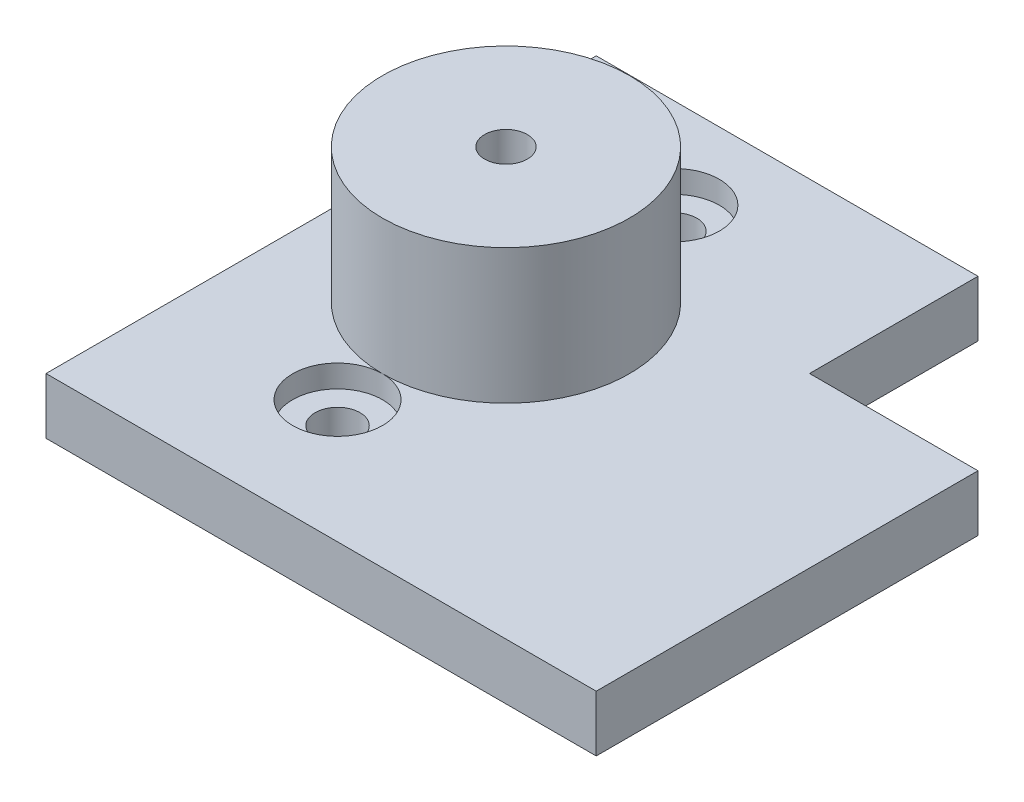
ISO-10303-21;
HEADER;
FILE_DESCRIPTION(('STEP AP214'),'2;1');
FILE_NAME('part.step','',(''),(''),'','','');
FILE_SCHEMA(('AUTOMOTIVE_DESIGN { 1 0 10303 214 1 1 1 1 }'));
ENDSEC;
DATA;
#1=APPLICATION_CONTEXT('core data for automotive mechanical design processes');
#2=APPLICATION_PROTOCOL_DEFINITION('international standard','automotive_design',2000,#1);
#3=PRODUCT_CONTEXT('',#1,'mechanical');
#4=PRODUCT('Part','Part','',(#3));
#5=PRODUCT_RELATED_PRODUCT_CATEGORY('part','',(#4));
#6=PRODUCT_DEFINITION_FORMATION('','',#4);
#7=PRODUCT_DEFINITION_CONTEXT('part definition',#1,'design');
#8=PRODUCT_DEFINITION('design','',#6,#7);
#9=PRODUCT_DEFINITION_SHAPE('','',#8);
#10=(LENGTH_UNIT() NAMED_UNIT(*) SI_UNIT(.MILLI.,.METRE.));
#11=(NAMED_UNIT(*) PLANE_ANGLE_UNIT() SI_UNIT($,.RADIAN.));
#12=(NAMED_UNIT(*) SI_UNIT($,.STERADIAN.) SOLID_ANGLE_UNIT());
#13=UNCERTAINTY_MEASURE_WITH_UNIT(LENGTH_MEASURE(1.E-05),#10,'distance_accuracy_value','');
#14=(GEOMETRIC_REPRESENTATION_CONTEXT(3) GLOBAL_UNCERTAINTY_ASSIGNED_CONTEXT((#13)) GLOBAL_UNIT_ASSIGNED_CONTEXT((#10,
#11,#12)) REPRESENTATION_CONTEXT('',''));
#15=CARTESIAN_POINT('',(0.,0.,0.));
#16=DIRECTION('',(0.,0.,1.));
#17=DIRECTION('',(1.,0.,0.));
#18=AXIS2_PLACEMENT_3D('',#15,#16,#17);
#19=CARTESIAN_POINT('',(15.,5.,-10.9634703196347));
#20=DIRECTION('',(0.,-1.,0.));
#21=DIRECTION('',(0.,0.,-1.));
#22=AXIS2_PLACEMENT_3D('',#19,#20,#21);
#23=CYLINDRICAL_SURFACE('',#22,2.);
#24=CARTESIAN_POINT('',(15.,0.,-10.9634703196347));
#25=DIRECTION('',(0.,1.,0.));
#26=DIRECTION('',(0.,0.,1.));
#27=AXIS2_PLACEMENT_3D('',#24,#25,#26);
#28=CIRCLE('',#27,2.);
#29=CARTESIAN_POINT('',(15.,0.,-8.96347031963469));
#30=VERTEX_POINT('',#29);
#31=EDGE_CURVE('E195',#30,#30,#28,.T.);
#32=ORIENTED_EDGE('',*,*,#31,.F.);
#33=EDGE_LOOP('',(#32));
#34=FACE_BOUND('',#33,.T.);
#35=CARTESIAN_POINT('',(15.,3.,-10.9634703196347));
#36=DIRECTION('',(0.,1.,0.));
#37=DIRECTION('',(0.,0.,1.));
#38=AXIS2_PLACEMENT_3D('',#35,#36,#37);
#39=CIRCLE('',#38,2.);
#40=CARTESIAN_POINT('',(15.,3.,-8.96347031963469));
#41=VERTEX_POINT('',#40);
#42=EDGE_CURVE('E43',#41,#41,#39,.T.);
#43=ORIENTED_EDGE('',*,*,#42,.T.);
#44=EDGE_LOOP('',(#43));
#45=FACE_BOUND('',#44,.T.);
#46=ADVANCED_FACE('F39',(#34,#45),#23,.F.);
#47=CARTESIAN_POINT('',(15.,5.,-40.9634703196347));
#48=DIRECTION('',(0.,-1.,0.));
#49=DIRECTION('',(0.,0.,-1.));
#50=AXIS2_PLACEMENT_3D('',#47,#48,#49);
#51=CYLINDRICAL_SURFACE('',#50,2.);
#52=CARTESIAN_POINT('',(15.,0.,-40.9634703196347));
#53=DIRECTION('',(0.,1.,0.));
#54=DIRECTION('',(0.,0.,1.));
#55=AXIS2_PLACEMENT_3D('',#52,#53,#54);
#56=CIRCLE('',#55,2.);
#57=CARTESIAN_POINT('',(15.,0.,-38.9634703196347));
#58=VERTEX_POINT('',#57);
#59=EDGE_CURVE('E153',#58,#58,#56,.T.);
#60=ORIENTED_EDGE('',*,*,#59,.F.);
#61=EDGE_LOOP('',(#60));
#62=FACE_BOUND('',#61,.T.);
#63=CARTESIAN_POINT('',(15.,3.,-40.9634703196347));
#64=DIRECTION('',(0.,1.,0.));
#65=DIRECTION('',(0.,0.,1.));
#66=AXIS2_PLACEMENT_3D('',#63,#64,#65);
#67=CIRCLE('',#66,2.);
#68=CARTESIAN_POINT('',(15.,3.,-38.9634703196347));
#69=VERTEX_POINT('',#68);
#70=EDGE_CURVE('E144',#69,#69,#67,.T.);
#71=ORIENTED_EDGE('',*,*,#70,.T.);
#72=EDGE_LOOP('',(#71));
#73=FACE_BOUND('',#72,.T.);
#74=ADVANCED_FACE('F41',(#62,#73),#51,.F.);
#75=CARTESIAN_POINT('',(34.,5.,0.));
#76=DIRECTION('',(1.,0.,0.));
#77=DIRECTION('',(0.,0.,-1.));
#78=AXIS2_PLACEMENT_3D('',#75,#76,#77);
#79=PLANE('',#78);
#80=DIRECTION('',(0.,0.,1.));
#81=VECTOR('',#80,1.);
#82=CARTESIAN_POINT('',(34.,0.,0.));
#83=LINE('',#82,#81);
#84=CARTESIAN_POINT('',(34.,0.,-49.));
#85=VERTEX_POINT('',#84);
#86=CARTESIAN_POINT('',(34.,0.,-34.));
#87=VERTEX_POINT('',#86);
#88=EDGE_CURVE('E199',#85,#87,#83,.T.);
#89=ORIENTED_EDGE('',*,*,#88,.F.);
#90=DIRECTION('',(0.,-1.,0.));
#91=VECTOR('',#90,1.);
#92=CARTESIAN_POINT('',(34.,5.,-49.));
#93=LINE('',#92,#91);
#94=CARTESIAN_POINT('',(34.,5.,-49.));
#95=VERTEX_POINT('',#94);
#96=EDGE_CURVE('E49',#95,#85,#93,.T.);
#97=ORIENTED_EDGE('',*,*,#96,.F.);
#98=DIRECTION('',(0.,0.,1.));
#99=VECTOR('',#98,1.);
#100=CARTESIAN_POINT('',(34.,5.,0.));
#101=LINE('',#100,#99);
#102=CARTESIAN_POINT('',(34.,5.,-34.));
#103=VERTEX_POINT('',#102);
#104=EDGE_CURVE('E176',#95,#103,#101,.T.);
#105=ORIENTED_EDGE('',*,*,#104,.T.);
#106=DIRECTION('',(0.,-1.,0.));
#107=VECTOR('',#106,1.);
#108=CARTESIAN_POINT('',(34.,5.,-34.));
#109=LINE('',#108,#107);
#110=EDGE_CURVE('E92',#103,#87,#109,.T.);
#111=ORIENTED_EDGE('',*,*,#110,.T.);
#112=EDGE_LOOP('',(#89,#97,#105,#111));
#113=FACE_BOUND('',#112,.T.);
#114=ADVANCED_FACE('F223',(#113),#79,.T.);
#115=CARTESIAN_POINT('',(0.,5.,-49.));
#116=DIRECTION('',(0.,0.,-1.));
#117=DIRECTION('',(-1.,0.,0.));
#118=AXIS2_PLACEMENT_3D('',#115,#116,#117);
#119=PLANE('',#118);
#120=DIRECTION('',(1.,0.,0.));
#121=VECTOR('',#120,1.);
#122=CARTESIAN_POINT('',(0.,0.,-49.));
#123=LINE('',#122,#121);
#124=CARTESIAN_POINT('',(0.,0.,-49.));
#125=VERTEX_POINT('',#124);
#126=EDGE_CURVE('E203',#125,#85,#123,.T.);
#127=ORIENTED_EDGE('',*,*,#126,.F.);
#128=DIRECTION('',(0.,-1.,0.));
#129=VECTOR('',#128,1.);
#130=CARTESIAN_POINT('',(0.,5.,-49.));
#131=LINE('',#130,#129);
#132=CARTESIAN_POINT('',(0.,5.,-49.));
#133=VERTEX_POINT('',#132);
#134=EDGE_CURVE('E136',#133,#125,#131,.T.);
#135=ORIENTED_EDGE('',*,*,#134,.F.);
#136=DIRECTION('',(1.,0.,0.));
#137=VECTOR('',#136,1.);
#138=CARTESIAN_POINT('',(0.,5.,-49.));
#139=LINE('',#138,#137);
#140=EDGE_CURVE('E179',#133,#95,#139,.T.);
#141=ORIENTED_EDGE('',*,*,#140,.T.);
#142=ORIENTED_EDGE('',*,*,#96,.T.);
#143=EDGE_LOOP('',(#127,#135,#141,#142));
#144=FACE_BOUND('',#143,.T.);
#145=ADVANCED_FACE('F225',(#144),#119,.T.);
#146=CARTESIAN_POINT('',(0.,5.,0.));
#147=DIRECTION('',(-1.,0.,0.));
#148=DIRECTION('',(0.,0.,1.));
#149=AXIS2_PLACEMENT_3D('',#146,#147,#148);
#150=PLANE('',#149);
#151=DIRECTION('',(0.,0.,-1.));
#152=VECTOR('',#151,1.);
#153=CARTESIAN_POINT('',(0.,0.,0.));
#154=LINE('',#153,#152);
#155=CARTESIAN_POINT('',(0.,0.,0.));
#156=VERTEX_POINT('',#155);
#157=EDGE_CURVE('E207',#156,#125,#154,.T.);
#158=ORIENTED_EDGE('',*,*,#157,.F.);
#159=DIRECTION('',(0.,-1.,0.));
#160=VECTOR('',#159,1.);
#161=CARTESIAN_POINT('',(0.,5.,0.));
#162=LINE('',#161,#160);
#163=CARTESIAN_POINT('',(0.,5.,0.));
#164=VERTEX_POINT('',#163);
#165=EDGE_CURVE('E132',#164,#156,#162,.T.);
#166=ORIENTED_EDGE('',*,*,#165,.F.);
#167=DIRECTION('',(0.,0.,-1.));
#168=VECTOR('',#167,1.);
#169=CARTESIAN_POINT('',(0.,5.,0.));
#170=LINE('',#169,#168);
#171=EDGE_CURVE('E124',#164,#133,#170,.T.);
#172=ORIENTED_EDGE('',*,*,#171,.T.);
#173=ORIENTED_EDGE('',*,*,#134,.T.);
#174=EDGE_LOOP('',(#158,#166,#172,#173));
#175=FACE_BOUND('',#174,.T.);
#176=ADVANCED_FACE('F231',(#175),#150,.T.);
#177=CARTESIAN_POINT('',(0.,5.,0.));
#178=DIRECTION('',(0.,0.,-1.));
#179=DIRECTION('',(-1.,0.,0.));
#180=AXIS2_PLACEMENT_3D('',#177,#178,#179);
#181=PLANE('',#180);
#182=DIRECTION('',(1.,0.,0.));
#183=VECTOR('',#182,1.);
#184=CARTESIAN_POINT('',(0.,0.,0.));
#185=LINE('',#184,#183);
#186=CARTESIAN_POINT('',(49.,0.,0.));
#187=VERTEX_POINT('',#186);
#188=EDGE_CURVE('E130',#156,#187,#185,.T.);
#189=ORIENTED_EDGE('',*,*,#188,.T.);
#190=DIRECTION('',(0.,-1.,0.));
#191=VECTOR('',#190,1.);
#192=CARTESIAN_POINT('',(49.,5.,0.));
#193=LINE('',#192,#191);
#194=CARTESIAN_POINT('',(49.,5.,0.));
#195=VERTEX_POINT('',#194);
#196=EDGE_CURVE('E112',#195,#187,#193,.T.);
#197=ORIENTED_EDGE('',*,*,#196,.F.);
#198=DIRECTION('',(1.,0.,0.));
#199=VECTOR('',#198,1.);
#200=CARTESIAN_POINT('',(0.,5.,0.));
#201=LINE('',#200,#199);
#202=EDGE_CURVE('E117',#164,#195,#201,.T.);
#203=ORIENTED_EDGE('',*,*,#202,.F.);
#204=ORIENTED_EDGE('',*,*,#165,.T.);
#205=EDGE_LOOP('',(#189,#197,#203,#204));
#206=FACE_BOUND('',#205,.T.);
#207=ADVANCED_FACE('F128',(#206),#181,.F.);
#208=CARTESIAN_POINT('',(49.,5.,0.));
#209=DIRECTION('',(-1.,0.,0.));
#210=DIRECTION('',(0.,0.,1.));
#211=AXIS2_PLACEMENT_3D('',#208,#209,#210);
#212=PLANE('',#211);
#213=DIRECTION('',(0.,0.,-1.));
#214=VECTOR('',#213,1.);
#215=CARTESIAN_POINT('',(49.,0.,0.));
#216=LINE('',#215,#214);
#217=CARTESIAN_POINT('',(49.,0.,-34.));
#218=VERTEX_POINT('',#217);
#219=EDGE_CURVE('E213',#187,#218,#216,.T.);
#220=ORIENTED_EDGE('',*,*,#219,.T.);
#221=DIRECTION('',(0.,-1.,0.));
#222=VECTOR('',#221,1.);
#223=CARTESIAN_POINT('',(49.,5.,-34.));
#224=LINE('',#223,#222);
#225=CARTESIAN_POINT('',(49.,5.,-34.));
#226=VERTEX_POINT('',#225);
#227=EDGE_CURVE('E115',#226,#218,#224,.T.);
#228=ORIENTED_EDGE('',*,*,#227,.F.);
#229=DIRECTION('',(0.,0.,-1.));
#230=VECTOR('',#229,1.);
#231=CARTESIAN_POINT('',(49.,5.,0.));
#232=LINE('',#231,#230);
#233=EDGE_CURVE('E107',#195,#226,#232,.T.);
#234=ORIENTED_EDGE('',*,*,#233,.F.);
#235=ORIENTED_EDGE('',*,*,#196,.T.);
#236=EDGE_LOOP('',(#220,#228,#234,#235));
#237=FACE_BOUND('',#236,.T.);
#238=ADVANCED_FACE('F110',(#237),#212,.F.);
#239=CARTESIAN_POINT('',(15.,5.,-25.9634703196347));
#240=DIRECTION('',(0.,-1.,0.));
#241=DIRECTION('',(0.,0.,-1.));
#242=AXIS2_PLACEMENT_3D('',#239,#240,#241);
#243=CYLINDRICAL_SURFACE('',#242,2.);
#244=CARTESIAN_POINT('',(15.,5.,-25.9634703196347));
#245=DIRECTION('',(0.,1.,0.));
#246=DIRECTION('',(0.,0.,1.));
#247=AXIS2_PLACEMENT_3D('',#244,#245,#246);
#248=CIRCLE('',#247,2.);
#249=CARTESIAN_POINT('',(15.,5.,-23.9634703196347));
#250=VERTEX_POINT('',#249);
#251=EDGE_CURVE('E171',#250,#250,#248,.T.);
#252=ORIENTED_EDGE('',*,*,#251,.T.);
#253=EDGE_LOOP('',(#252));
#254=FACE_BOUND('',#253,.T.);
#255=CARTESIAN_POINT('',(15.,0.,-25.9634703196347));
#256=DIRECTION('',(0.,1.,0.));
#257=DIRECTION('',(0.,0.,1.));
#258=AXIS2_PLACEMENT_3D('',#255,#256,#257);
#259=CIRCLE('',#258,2.);
#260=CARTESIAN_POINT('',(15.,0.,-23.9634703196347));
#261=VERTEX_POINT('',#260);
#262=EDGE_CURVE('E191',#261,#261,#259,.T.);
#263=ORIENTED_EDGE('',*,*,#262,.F.);
#264=EDGE_LOOP('',(#263));
#265=FACE_BOUND('',#264,.T.);
#266=ADVANCED_FACE('F242',(#254,#265),#243,.F.);
#267=CARTESIAN_POINT('',(0.,5.,-34.));
#268=DIRECTION('',(0.,0.,1.));
#269=DIRECTION('',(1.,0.,0.));
#270=AXIS2_PLACEMENT_3D('',#267,#268,#269);
#271=PLANE('',#270);
#272=DIRECTION('',(-1.,0.,0.));
#273=VECTOR('',#272,1.);
#274=CARTESIAN_POINT('',(0.,0.,-34.));
#275=LINE('',#274,#273);
#276=EDGE_CURVE('E180',#218,#87,#275,.T.);
#277=ORIENTED_EDGE('',*,*,#276,.T.);
#278=ORIENTED_EDGE('',*,*,#110,.F.);
#279=DIRECTION('',(-1.,0.,0.));
#280=VECTOR('',#279,1.);
#281=CARTESIAN_POINT('',(0.,5.,-34.));
#282=LINE('',#281,#280);
#283=EDGE_CURVE('E65',#226,#103,#282,.T.);
#284=ORIENTED_EDGE('',*,*,#283,.F.);
#285=ORIENTED_EDGE('',*,*,#227,.T.);
#286=EDGE_LOOP('',(#277,#278,#284,#285));
#287=FACE_BOUND('',#286,.T.);
#288=ADVANCED_FACE('F219',(#287),#271,.F.);
#289=CARTESIAN_POINT('',(0.,5.,0.));
#290=DIRECTION('',(0.,1.,0.));
#291=DIRECTION('',(0.,0.,1.));
#292=AXIS2_PLACEMENT_3D('',#289,#290,#291);
#293=PLANE('',#292);
#294=CARTESIAN_POINT('',(15.,5.,-25.9634703196347));
#295=DIRECTION('',(0.,1.,0.));
#296=DIRECTION('',(0.,0.,1.));
#297=AXIS2_PLACEMENT_3D('',#294,#295,#296);
#298=CIRCLE('',#297,11.);
#299=CARTESIAN_POINT('',(15.,5.,-14.9634703196347));
#300=VERTEX_POINT('',#299);
#301=CARTESIAN_POINT('',(15.,5.,-36.9634703196347));
#302=VERTEX_POINT('',#301);
#303=EDGE_CURVE('E51',#300,#302,#298,.T.);
#304=ORIENTED_EDGE('',*,*,#303,.F.);
#305=CARTESIAN_POINT('',(15.,5.,-10.9634703196347));
#306=DIRECTION('',(0.,1.,0.));
#307=DIRECTION('',(0.,0.,1.));
#308=AXIS2_PLACEMENT_3D('',#305,#306,#307);
#309=CIRCLE('',#308,4.);
#310=EDGE_CURVE('E167',#300,#300,#309,.T.);
#311=ORIENTED_EDGE('',*,*,#310,.F.);
#312=EDGE_CURVE('E11',#302,#300,#298,.T.);
#313=ORIENTED_EDGE('',*,*,#312,.F.);
#314=CARTESIAN_POINT('',(15.,5.,-40.9634703196347));
#315=DIRECTION('',(0.,1.,0.));
#316=DIRECTION('',(0.,0.,1.));
#317=AXIS2_PLACEMENT_3D('',#314,#315,#316);
#318=CIRCLE('',#317,4.);
#319=EDGE_CURVE('E155',#302,#302,#318,.T.);
#320=ORIENTED_EDGE('',*,*,#319,.F.);
#321=EDGE_LOOP('',(#304,#311,#313,#320));
#322=FACE_BOUND('',#321,.T.);
#323=ORIENTED_EDGE('',*,*,#104,.F.);
#324=ORIENTED_EDGE('',*,*,#140,.F.);
#325=ORIENTED_EDGE('',*,*,#171,.F.);
#326=ORIENTED_EDGE('',*,*,#202,.T.);
#327=ORIENTED_EDGE('',*,*,#233,.T.);
#328=ORIENTED_EDGE('',*,*,#283,.T.);
#329=EDGE_LOOP('',(#323,#324,#325,#326,#327,#328));
#330=FACE_BOUND('',#329,.T.);
#331=ADVANCED_FACE('F121',(#322,#330),#293,.T.);
#332=CARTESIAN_POINT('',(0.,0.,0.));
#333=DIRECTION('',(0.,1.,0.));
#334=DIRECTION('',(0.,0.,1.));
#335=AXIS2_PLACEMENT_3D('',#332,#333,#334);
#336=PLANE('',#335);
#337=ORIENTED_EDGE('',*,*,#59,.T.);
#338=EDGE_LOOP('',(#337));
#339=FACE_BOUND('',#338,.T.);
#340=ORIENTED_EDGE('',*,*,#262,.T.);
#341=EDGE_LOOP('',(#340));
#342=FACE_BOUND('',#341,.T.);
#343=ORIENTED_EDGE('',*,*,#31,.T.);
#344=EDGE_LOOP('',(#343));
#345=FACE_BOUND('',#344,.T.);
#346=ORIENTED_EDGE('',*,*,#88,.T.);
#347=ORIENTED_EDGE('',*,*,#276,.F.);
#348=ORIENTED_EDGE('',*,*,#219,.F.);
#349=ORIENTED_EDGE('',*,*,#188,.F.);
#350=ORIENTED_EDGE('',*,*,#157,.T.);
#351=ORIENTED_EDGE('',*,*,#126,.T.);
#352=EDGE_LOOP('',(#346,#347,#348,#349,#350,#351));
#353=FACE_BOUND('',#352,.T.);
#354=ADVANCED_FACE('F221',(#339,#342,#345,#353),#336,.F.);
#355=CARTESIAN_POINT('',(15.,3.,-10.9634703196347));
#356=DIRECTION('',(0.,1.,0.));
#357=DIRECTION('',(0.,0.,1.));
#358=AXIS2_PLACEMENT_3D('',#355,#356,#357);
#359=CYLINDRICAL_SURFACE('',#358,4.);
#360=CARTESIAN_POINT('',(15.,3.,-10.9634703196347));
#361=DIRECTION('',(0.,1.,0.));
#362=DIRECTION('',(0.,0.,1.));
#363=AXIS2_PLACEMENT_3D('',#360,#361,#362);
#364=CIRCLE('',#363,4.);
#365=CARTESIAN_POINT('',(15.,3.,-6.9634703196347));
#366=VERTEX_POINT('',#365);
#367=EDGE_CURVE('E160',#366,#366,#364,.T.);
#368=ORIENTED_EDGE('',*,*,#367,.F.);
#369=EDGE_LOOP('',(#368));
#370=FACE_BOUND('',#369,.T.);
#371=ORIENTED_EDGE('',*,*,#310,.T.);
#372=EDGE_LOOP('',(#371));
#373=FACE_BOUND('',#372,.T.);
#374=ADVANCED_FACE('F257',(#370,#373),#359,.F.);
#375=CARTESIAN_POINT('',(15.,3.,-10.9634703196347));
#376=DIRECTION('',(0.,1.,0.));
#377=DIRECTION('',(0.,0.,1.));
#378=AXIS2_PLACEMENT_3D('',#375,#376,#377);
#379=PLANE('',#378);
#380=ORIENTED_EDGE('',*,*,#42,.F.);
#381=EDGE_LOOP('',(#380));
#382=FACE_BOUND('',#381,.T.);
#383=ORIENTED_EDGE('',*,*,#367,.T.);
#384=EDGE_LOOP('',(#383));
#385=FACE_BOUND('',#384,.T.);
#386=ADVANCED_FACE('F264',(#382,#385),#379,.T.);
#387=CARTESIAN_POINT('',(15.,3.,-40.9634703196347));
#388=DIRECTION('',(0.,1.,0.));
#389=DIRECTION('',(0.,0.,1.));
#390=AXIS2_PLACEMENT_3D('',#387,#388,#389);
#391=CYLINDRICAL_SURFACE('',#390,4.);
#392=CARTESIAN_POINT('',(15.,3.,-40.9634703196347));
#393=DIRECTION('',(0.,1.,0.));
#394=DIRECTION('',(0.,0.,1.));
#395=AXIS2_PLACEMENT_3D('',#392,#393,#394);
#396=CIRCLE('',#395,4.);
#397=CARTESIAN_POINT('',(15.,3.,-36.9634703196347));
#398=VERTEX_POINT('',#397);
#399=EDGE_CURVE('E147',#398,#398,#396,.T.);
#400=ORIENTED_EDGE('',*,*,#399,.F.);
#401=EDGE_LOOP('',(#400));
#402=FACE_BOUND('',#401,.T.);
#403=ORIENTED_EDGE('',*,*,#319,.T.);
#404=EDGE_LOOP('',(#403));
#405=FACE_BOUND('',#404,.T.);
#406=ADVANCED_FACE('F321',(#402,#405),#391,.F.);
#407=CARTESIAN_POINT('',(15.,3.,-40.9634703196347));
#408=DIRECTION('',(0.,1.,0.));
#409=DIRECTION('',(0.,0.,1.));
#410=AXIS2_PLACEMENT_3D('',#407,#408,#409);
#411=PLANE('',#410);
#412=ORIENTED_EDGE('',*,*,#70,.F.);
#413=EDGE_LOOP('',(#412));
#414=FACE_BOUND('',#413,.T.);
#415=ORIENTED_EDGE('',*,*,#399,.T.);
#416=EDGE_LOOP('',(#415));
#417=FACE_BOUND('',#416,.T.);
#418=ADVANCED_FACE('F329',(#414,#417),#411,.T.);
#419=CARTESIAN_POINT('',(15.,17.,-25.9634703196347));
#420=DIRECTION('',(0.,1.,0.));
#421=DIRECTION('',(0.,0.,1.));
#422=AXIS2_PLACEMENT_3D('',#419,#420,#421);
#423=PLANE('',#422);
#424=CARTESIAN_POINT('',(15.,17.,-25.9634703196347));
#425=DIRECTION('',(0.,1.,0.));
#426=DIRECTION('',(0.,0.,1.));
#427=AXIS2_PLACEMENT_3D('',#424,#425,#426);
#428=CIRCLE('',#427,11.);
#429=CARTESIAN_POINT('',(15.,17.,-14.9634703196347));
#430=VERTEX_POINT('',#429);
#431=EDGE_CURVE('E175',#430,#430,#428,.T.);
#432=ORIENTED_EDGE('',*,*,#431,.T.);
#433=EDGE_LOOP('',(#432));
#434=FACE_BOUND('',#433,.T.);
#435=CARTESIAN_POINT('',(15.,17.,-25.9634703196347));
#436=DIRECTION('',(0.,1.,0.));
#437=DIRECTION('',(0.,0.,1.));
#438=AXIS2_PLACEMENT_3D('',#435,#436,#437);
#439=CIRCLE('',#438,1.90162163484388);
#440=CARTESIAN_POINT('',(15.,17.,-24.0618486847908));
#441=VERTEX_POINT('',#440);
#442=EDGE_CURVE('E398',#441,#441,#439,.T.);
#443=ORIENTED_EDGE('',*,*,#442,.F.);
#444=EDGE_LOOP('',(#443));
#445=FACE_BOUND('',#444,.T.);
#446=ADVANCED_FACE('F334',(#434,#445),#423,.T.);
#447=CARTESIAN_POINT('',(15.,5.,-25.9634703196347));
#448=DIRECTION('',(0.,1.,0.));
#449=DIRECTION('',(0.,0.,1.));
#450=AXIS2_PLACEMENT_3D('',#447,#448,#449);
#451=PLANE('',#450);
#452=ORIENTED_EDGE('',*,*,#251,.F.);
#453=EDGE_LOOP('',(#452));
#454=FACE_BOUND('',#453,.T.);
#455=CARTESIAN_POINT('',(15.,5.,-25.9634703196347));
#456=DIRECTION('',(0.,1.,0.));
#457=DIRECTION('',(0.,0.,1.));
#458=AXIS2_PLACEMENT_3D('',#455,#456,#457);
#459=CIRCLE('',#458,1.90162163484388);
#460=CARTESIAN_POINT('',(15.,5.,-24.0618486847908));
#461=VERTEX_POINT('',#460);
#462=EDGE_CURVE('E401',#461,#461,#459,.T.);
#463=ORIENTED_EDGE('',*,*,#462,.T.);
#464=EDGE_LOOP('',(#463));
#465=FACE_BOUND('',#464,.T.);
#466=ADVANCED_FACE('F361',(#454,#465),#451,.F.);
#467=CARTESIAN_POINT('',(15.,17.,-25.9634703196347));
#468=DIRECTION('',(0.,-1.,0.));
#469=DIRECTION('',(0.,0.,-1.));
#470=AXIS2_PLACEMENT_3D('',#467,#468,#469);
#471=CYLINDRICAL_SURFACE('',#470,11.);
#472=ORIENTED_EDGE('',*,*,#431,.F.);
#473=EDGE_LOOP('',(#472));
#474=FACE_BOUND('',#473,.T.);
#475=ORIENTED_EDGE('',*,*,#303,.T.);
#476=ORIENTED_EDGE('',*,*,#312,.T.);
#477=EDGE_LOOP('',(#475,#476));
#478=FACE_BOUND('',#477,.T.);
#479=ADVANCED_FACE('F371',(#474,#478),#471,.T.);
#480=CARTESIAN_POINT('',(15.,17.,-25.9634703196347));
#481=DIRECTION('',(0.,-1.,0.));
#482=DIRECTION('',(0.,0.,-1.));
#483=AXIS2_PLACEMENT_3D('',#480,#481,#482);
#484=CYLINDRICAL_SURFACE('',#483,1.90162163484388);
#485=ORIENTED_EDGE('',*,*,#442,.T.);
#486=EDGE_LOOP('',(#485));
#487=FACE_BOUND('',#486,.T.);
#488=ORIENTED_EDGE('',*,*,#462,.F.);
#489=EDGE_LOOP('',(#488));
#490=FACE_BOUND('',#489,.T.);
#491=ADVANCED_FACE('F381',(#487,#490),#484,.F.);
#492=CLOSED_SHELL('',(#46,#74,#114,#145,#176,#207,#238,#266,#288,#331,#354,#374,#386,#406,#418,
#446,#466,#479,#491));
#493=MANIFOLD_SOLID_BREP('B2',#492);
#494=ADVANCED_BREP_SHAPE_REPRESENTATION('',(#18,#493),#14);
#495=SHAPE_DEFINITION_REPRESENTATION(#9,#494);
ENDSEC;
END-ISO-10303-21;
